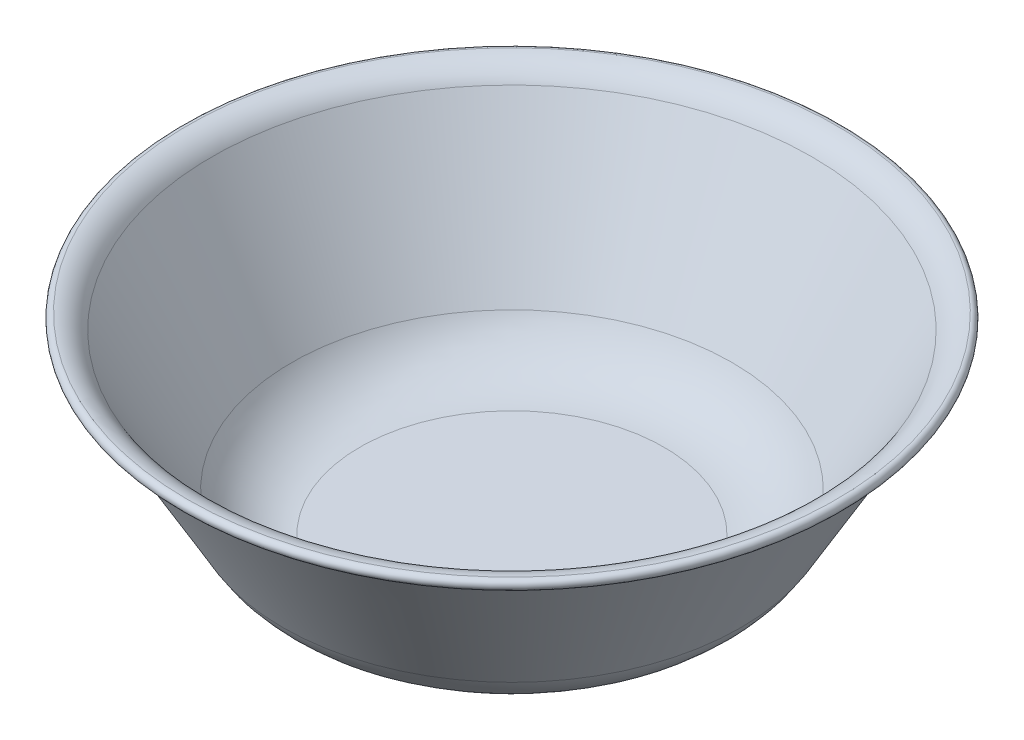
ISO-10303-21;
HEADER;
FILE_DESCRIPTION(('STEP AP214'),'2;1');
FILE_NAME('part.step','',(''),(''),'','','');
FILE_SCHEMA(('AUTOMOTIVE_DESIGN { 1 0 10303 214 1 1 1 1 }'));
ENDSEC;
DATA;
#1=APPLICATION_CONTEXT('core data for automotive mechanical design processes');
#2=APPLICATION_PROTOCOL_DEFINITION('international standard','automotive_design',2000,#1);
#3=PRODUCT_CONTEXT('',#1,'mechanical');
#4=PRODUCT('Part','Part','',(#3));
#5=PRODUCT_RELATED_PRODUCT_CATEGORY('part','',(#4));
#6=PRODUCT_DEFINITION_FORMATION('','',#4);
#7=PRODUCT_DEFINITION_CONTEXT('part definition',#1,'design');
#8=PRODUCT_DEFINITION('design','',#6,#7);
#9=PRODUCT_DEFINITION_SHAPE('','',#8);
#10=(LENGTH_UNIT() NAMED_UNIT(*) SI_UNIT(.MILLI.,.METRE.));
#11=(NAMED_UNIT(*) PLANE_ANGLE_UNIT() SI_UNIT($,.RADIAN.));
#12=(NAMED_UNIT(*) SI_UNIT($,.STERADIAN.) SOLID_ANGLE_UNIT());
#13=UNCERTAINTY_MEASURE_WITH_UNIT(LENGTH_MEASURE(1.E-05),#10,'distance_accuracy_value','');
#14=(GEOMETRIC_REPRESENTATION_CONTEXT(3) GLOBAL_UNCERTAINTY_ASSIGNED_CONTEXT((#13)) GLOBAL_UNIT_ASSIGNED_CONTEXT((#10,
#11,#12)) REPRESENTATION_CONTEXT('',''));
#15=CARTESIAN_POINT('',(0.,0.,0.));
#16=DIRECTION('',(0.,0.,1.));
#17=DIRECTION('',(1.,0.,0.));
#18=AXIS2_PLACEMENT_3D('',#15,#16,#17);
#19=CARTESIAN_POINT('',(0.,19.8451727067641,0.));
#20=DIRECTION('',(0.,-1.,0.));
#21=DIRECTION('',(0.,0.,-1.));
#22=AXIS2_PLACEMENT_3D('',#19,#20,#21);
#23=PLANE('',#22);
#24=CARTESIAN_POINT('',(0.,19.8451727067641,0.));
#25=DIRECTION('',(0.,1.,0.));
#26=DIRECTION('',(0.,0.,1.));
#27=AXIS2_PLACEMENT_3D('',#24,#25,#26);
#28=CIRCLE('',#27,30.);
#29=CARTESIAN_POINT('',(0.,19.8451727067641,30.));
#30=VERTEX_POINT('',#29);
#31=EDGE_CURVE('E10',#30,#30,#28,.T.);
#32=ORIENTED_EDGE('',*,*,#31,.T.);
#33=EDGE_LOOP('',(#32));
#34=FACE_BOUND('',#33,.T.);
#35=ADVANCED_FACE('F34',(#34),#23,.F.);
#36=CARTESIAN_POINT('',(0.,35.3451727067641,0.));
#37=DIRECTION('',(0.,1.,0.));
#38=DIRECTION('',(0.,0.,1.));
#39=AXIS2_PLACEMENT_3D('',#36,#37,#38);
#40=TOROIDAL_SURFACE('',#39,30.,15.5);
#41=ORIENTED_EDGE('',*,*,#31,.F.);
#42=EDGE_LOOP('',(#41));
#43=FACE_BOUND('',#42,.T.);
#44=CARTESIAN_POINT('',(0.,27.595172706764,0.));
#45=DIRECTION('',(0.,1.,0.));
#46=DIRECTION('',(0.,0.,1.));
#47=AXIS2_PLACEMENT_3D('',#44,#45,#46);
#48=CIRCLE('',#47,43.4233937586588);
#49=CARTESIAN_POINT('',(0.,27.595172706764,43.4233937586588));
#50=VERTEX_POINT('',#49);
#51=EDGE_CURVE('E40',#50,#50,#48,.T.);
#52=ORIENTED_EDGE('',*,*,#51,.T.);
#53=EDGE_LOOP('',(#52));
#54=FACE_BOUND('',#53,.T.);
#55=ADVANCED_FACE('F78',(#43,#54),#40,.F.);
#56=CARTESIAN_POINT('',(0.,54.8581369851873,0.));
#57=DIRECTION('',(0.,1.,0.));
#58=DIRECTION('',(0.,0.,1.));
#59=AXIS2_PLACEMENT_3D('',#56,#57,#58);
#60=CONICAL_SURFACE('',#59,59.1636735237136,0.5235987755983);
#61=ORIENTED_EDGE('',*,*,#51,.F.);
#62=EDGE_LOOP('',(#61));
#63=FACE_BOUND('',#62,.T.);
#64=CARTESIAN_POINT('',(0.,54.8581369851873,0.));
#65=DIRECTION('',(0.,1.,0.));
#66=DIRECTION('',(0.,0.,1.));
#67=AXIS2_PLACEMENT_3D('',#64,#65,#66);
#68=CIRCLE('',#67,59.1636735237136);
#69=CARTESIAN_POINT('',(0.,54.8581369851873,59.1636735237136));
#70=VERTEX_POINT('',#69);
#71=EDGE_CURVE('E44',#70,#70,#68,.T.);
#72=ORIENTED_EDGE('',*,*,#71,.T.);
#73=EDGE_LOOP('',(#72));
#74=FACE_BOUND('',#73,.T.);
#75=ADVANCED_FACE('F82',(#63,#74),#60,.F.);
#76=CARTESIAN_POINT('',(0.,51.8581369851873,0.));
#77=DIRECTION('',(0.,1.,0.));
#78=DIRECTION('',(0.,0.,1.));
#79=AXIS2_PLACEMENT_3D('',#76,#77,#78);
#80=TOROIDAL_SURFACE('',#79,64.3598259464203,6.00000000000001);
#81=ORIENTED_EDGE('',*,*,#71,.F.);
#82=EDGE_LOOP('',(#81));
#83=FACE_BOUND('',#82,.T.);
#84=CARTESIAN_POINT('',(0.,57.8425798510794,0.));
#85=DIRECTION('',(0.,1.,0.));
#86=DIRECTION('',(0.,0.,1.));
#87=AXIS2_PLACEMENT_3D('',#84,#85,#86);
#88=CIRCLE('',#87,63.9280348107159);
#89=CARTESIAN_POINT('',(0.,57.8425798510794,63.9280348107159));
#90=VERTEX_POINT('',#89);
#91=EDGE_CURVE('E48',#90,#90,#88,.T.);
#92=ORIENTED_EDGE('',*,*,#91,.T.);
#93=EDGE_LOOP('',(#92));
#94=FACE_BOUND('',#93,.T.);
#95=ADVANCED_FACE('F87',(#83,#94),#80,.T.);
#96=CARTESIAN_POINT('',(0.,56.8451727067641,0.));
#97=DIRECTION('',(0.,1.,0.));
#98=DIRECTION('',(0.,0.,1.));
#99=AXIS2_PLACEMENT_3D('',#96,#97,#98);
#100=TOROIDAL_SURFACE('',#99,64.,1.00000000000001);
#101=ORIENTED_EDGE('',*,*,#91,.F.);
#102=EDGE_LOOP('',(#101));
#103=FACE_BOUND('',#102,.T.);
#104=CARTESIAN_POINT('',(0.,55.8477655624487,0.));
#105=DIRECTION('',(0.,1.,0.));
#106=DIRECTION('',(0.,0.,1.));
#107=AXIS2_PLACEMENT_3D('',#104,#105,#106);
#108=CIRCLE('',#107,64.0719651892841);
#109=CARTESIAN_POINT('',(0.,55.8477655624487,64.0719651892841));
#110=VERTEX_POINT('',#109);
#111=EDGE_CURVE('E53',#110,#110,#108,.T.);
#112=ORIENTED_EDGE('',*,*,#111,.T.);
#113=EDGE_LOOP('',(#112));
#114=FACE_BOUND('',#113,.T.);
#115=ADVANCED_FACE('F93',(#103,#114),#100,.T.);
#116=CARTESIAN_POINT('',(0.,51.8581369851873,0.));
#117=DIRECTION('',(0.,1.,0.));
#118=DIRECTION('',(0.,0.,1.));
#119=AXIS2_PLACEMENT_3D('',#116,#117,#118);
#120=TOROIDAL_SURFACE('',#119,64.3598259464203,4.00000000000001);
#121=ORIENTED_EDGE('',*,*,#111,.F.);
#122=EDGE_LOOP('',(#121));
#123=FACE_BOUND('',#122,.T.);
#124=CARTESIAN_POINT('',(0.,53.8581369851873,0.));
#125=DIRECTION('',(0.,1.,0.));
#126=DIRECTION('',(0.,0.,1.));
#127=AXIS2_PLACEMENT_3D('',#124,#125,#126);
#128=CIRCLE('',#127,60.8957243312825);
#129=CARTESIAN_POINT('',(0.,53.8581369851873,60.8957243312825));
#130=VERTEX_POINT('',#129);
#131=EDGE_CURVE('E56',#130,#130,#128,.T.);
#132=ORIENTED_EDGE('',*,*,#131,.T.);
#133=EDGE_LOOP('',(#132));
#134=FACE_BOUND('',#133,.T.);
#135=ADVANCED_FACE('F97',(#123,#134),#120,.F.);
#136=CARTESIAN_POINT('',(0.,26.595172706764,0.));
#137=DIRECTION('',(0.,1.,0.));
#138=DIRECTION('',(0.,0.,1.));
#139=AXIS2_PLACEMENT_3D('',#136,#137,#138);
#140=CONICAL_SURFACE('',#139,45.1554445662277,0.523598775598299);
#141=ORIENTED_EDGE('',*,*,#131,.F.);
#142=EDGE_LOOP('',(#141));
#143=FACE_BOUND('',#142,.T.);
#144=CARTESIAN_POINT('',(0.,26.595172706764,0.));
#145=DIRECTION('',(0.,1.,0.));
#146=DIRECTION('',(0.,0.,1.));
#147=AXIS2_PLACEMENT_3D('',#144,#145,#146);
#148=CIRCLE('',#147,45.1554445662277);
#149=CARTESIAN_POINT('',(0.,26.595172706764,45.1554445662277));
#150=VERTEX_POINT('',#149);
#151=EDGE_CURVE('E59',#150,#150,#148,.T.);
#152=ORIENTED_EDGE('',*,*,#151,.T.);
#153=EDGE_LOOP('',(#152));
#154=FACE_BOUND('',#153,.T.);
#155=ADVANCED_FACE('F74',(#143,#154),#140,.T.);
#156=CARTESIAN_POINT('',(0.,35.3451727067641,0.));
#157=DIRECTION('',(0.,1.,0.));
#158=DIRECTION('',(0.,0.,1.));
#159=AXIS2_PLACEMENT_3D('',#156,#157,#158);
#160=TOROIDAL_SURFACE('',#159,30.,17.5);
#161=ORIENTED_EDGE('',*,*,#151,.F.);
#162=EDGE_LOOP('',(#161));
#163=FACE_BOUND('',#162,.T.);
#164=CARTESIAN_POINT('',(0.,17.8451727067641,0.));
#165=DIRECTION('',(0.,1.,0.));
#166=DIRECTION('',(0.,0.,1.));
#167=AXIS2_PLACEMENT_3D('',#164,#165,#166);
#168=CIRCLE('',#167,30.);
#169=CARTESIAN_POINT('',(0.,17.8451727067641,30.));
#170=VERTEX_POINT('',#169);
#171=EDGE_CURVE('E62',#170,#170,#168,.T.);
#172=ORIENTED_EDGE('',*,*,#171,.T.);
#173=EDGE_LOOP('',(#172));
#174=FACE_BOUND('',#173,.T.);
#175=ADVANCED_FACE('F66',(#163,#174),#160,.T.);
#176=CARTESIAN_POINT('',(0.,17.8451727067641,0.));
#177=DIRECTION('',(0.,1.,0.));
#178=DIRECTION('',(0.,0.,1.));
#179=AXIS2_PLACEMENT_3D('',#176,#177,#178);
#180=PLANE('',#179);
#181=ORIENTED_EDGE('',*,*,#171,.F.);
#182=EDGE_LOOP('',(#181));
#183=FACE_BOUND('',#182,.T.);
#184=ADVANCED_FACE('F68',(#183),#180,.F.);
#185=CLOSED_SHELL('',(#35,#55,#75,#95,#115,#135,#155,#175,#184));
#186=MANIFOLD_SOLID_BREP('B2',#185);
#187=ADVANCED_BREP_SHAPE_REPRESENTATION('',(#18,#186),#14);
#188=SHAPE_DEFINITION_REPRESENTATION(#9,#187);
ENDSEC;
END-ISO-10303-21;
